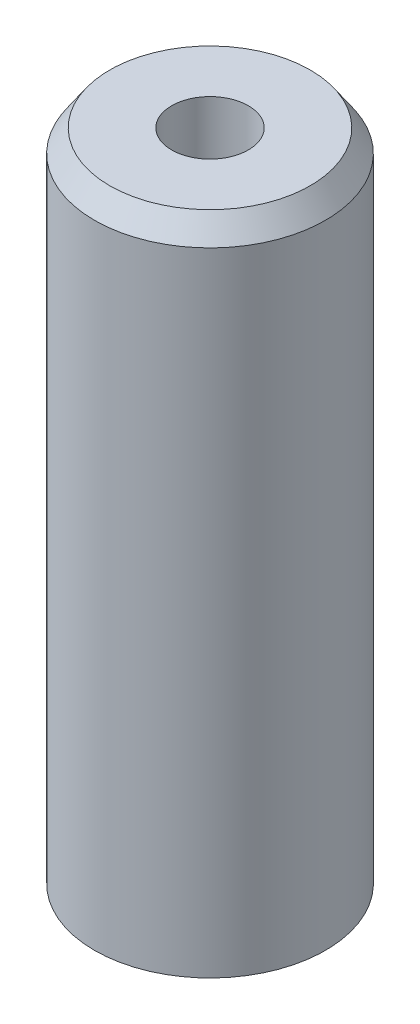
ISO-10303-21;
HEADER;
FILE_DESCRIPTION(('STEP AP214'),'2;1');
FILE_NAME('part.step','',(''),(''),'','','');
FILE_SCHEMA(('AUTOMOTIVE_DESIGN { 1 0 10303 214 1 1 1 1 }'));
ENDSEC;
DATA;
#1=APPLICATION_CONTEXT('core data for automotive mechanical design processes');
#2=APPLICATION_PROTOCOL_DEFINITION('international standard','automotive_design',2000,#1);
#3=PRODUCT_CONTEXT('',#1,'mechanical');
#4=PRODUCT('Part','Part','',(#3));
#5=PRODUCT_RELATED_PRODUCT_CATEGORY('part','',(#4));
#6=PRODUCT_DEFINITION_FORMATION('','',#4);
#7=PRODUCT_DEFINITION_CONTEXT('part definition',#1,'design');
#8=PRODUCT_DEFINITION('design','',#6,#7);
#9=PRODUCT_DEFINITION_SHAPE('','',#8);
#10=(LENGTH_UNIT() NAMED_UNIT(*) SI_UNIT(.MILLI.,.METRE.));
#11=(NAMED_UNIT(*) PLANE_ANGLE_UNIT() SI_UNIT($,.RADIAN.));
#12=(NAMED_UNIT(*) SI_UNIT($,.STERADIAN.) SOLID_ANGLE_UNIT());
#13=UNCERTAINTY_MEASURE_WITH_UNIT(LENGTH_MEASURE(1.E-05),#10,'distance_accuracy_value','');
#14=(GEOMETRIC_REPRESENTATION_CONTEXT(3) GLOBAL_UNCERTAINTY_ASSIGNED_CONTEXT((#13)) GLOBAL_UNIT_ASSIGNED_CONTEXT((#10,
#11,#12)) REPRESENTATION_CONTEXT('',''));
#15=CARTESIAN_POINT('',(0.,0.,0.));
#16=DIRECTION('',(0.,0.,1.));
#17=DIRECTION('',(1.,0.,0.));
#18=AXIS2_PLACEMENT_3D('',#15,#16,#17);
#19=CARTESIAN_POINT('',(0.,159.441665289434,0.));
#20=DIRECTION('',(0.,-1.,0.));
#21=DIRECTION('',(0.,0.,-1.));
#22=AXIS2_PLACEMENT_3D('',#19,#20,#21);
#23=CYLINDRICAL_SURFACE('',#22,27.5);
#24=CARTESIAN_POINT('',(0.,154.132473192236,0.));
#25=DIRECTION('',(0.,1.,0.));
#26=DIRECTION('',(0.,0.,1.));
#27=AXIS2_PLACEMENT_3D('',#24,#25,#26);
#28=CIRCLE('',#27,27.5);
#29=CARTESIAN_POINT('',(0.,154.132473192236,27.5));
#30=VERTEX_POINT('',#29);
#31=EDGE_CURVE('E50',#30,#30,#28,.F.);
#32=ORIENTED_EDGE('',*,*,#31,.T.);
#33=EDGE_LOOP('',(#32));
#34=FACE_BOUND('',#33,.T.);
#35=CARTESIAN_POINT('',(0.,3.63032318695186,0.));
#36=DIRECTION('',(0.,1.,0.));
#37=DIRECTION('',(0.,0.,1.));
#38=AXIS2_PLACEMENT_3D('',#35,#36,#37);
#39=CIRCLE('',#38,27.5);
#40=CARTESIAN_POINT('',(0.,3.63032318695186,27.5));
#41=VERTEX_POINT('',#40);
#42=EDGE_CURVE('E51',#41,#41,#39,.T.);
#43=ORIENTED_EDGE('',*,*,#42,.T.);
#44=EDGE_LOOP('',(#43));
#45=FACE_BOUND('',#44,.T.);
#46=ADVANCED_FACE('F39',(#34,#45),#23,.T.);
#47=CARTESIAN_POINT('',(0.,159.441665289434,0.));
#48=DIRECTION('',(0.,1.,0.));
#49=DIRECTION('',(0.,0.,1.));
#50=AXIS2_PLACEMENT_3D('',#47,#48,#49);
#51=PLANE('',#50);
#52=CARTESIAN_POINT('',(0.,159.441665289434,0.));
#53=DIRECTION('',(0.,1.,0.));
#54=DIRECTION('',(0.,0.,1.));
#55=AXIS2_PLACEMENT_3D('',#52,#53,#54);
#56=CIRCLE('',#55,23.8696768130482);
#57=CARTESIAN_POINT('',(0.,159.441665289434,23.8696768130482));
#58=VERTEX_POINT('',#57);
#59=EDGE_CURVE('E54',#58,#58,#56,.T.);
#60=ORIENTED_EDGE('',*,*,#59,.T.);
#61=EDGE_LOOP('',(#60));
#62=FACE_BOUND('',#61,.T.);
#63=CARTESIAN_POINT('',(0.,159.441665289434,0.));
#64=DIRECTION('',(0.,1.,0.));
#65=DIRECTION('',(0.,0.,1.));
#66=AXIS2_PLACEMENT_3D('',#63,#64,#65);
#67=CIRCLE('',#66,9.126958465946);
#68=CARTESIAN_POINT('',(0.,159.441665289434,9.126958465946));
#69=VERTEX_POINT('',#68);
#70=EDGE_CURVE('E58',#69,#69,#67,.T.);
#71=ORIENTED_EDGE('',*,*,#70,.F.);
#72=EDGE_LOOP('',(#71));
#73=FACE_BOUND('',#72,.T.);
#74=ADVANCED_FACE('F69',(#62,#73),#51,.T.);
#75=CARTESIAN_POINT('',(0.,0.,0.));
#76=DIRECTION('',(0.,1.,0.));
#77=DIRECTION('',(0.,0.,1.));
#78=AXIS2_PLACEMENT_3D('',#75,#76,#77);
#79=PLANE('',#78);
#80=CARTESIAN_POINT('',(0.,0.,0.));
#81=DIRECTION('',(0.,1.,0.));
#82=DIRECTION('',(0.,0.,1.));
#83=AXIS2_PLACEMENT_3D('',#80,#81,#82);
#84=CIRCLE('',#83,22.1908079028014);
#85=CARTESIAN_POINT('',(0.,0.,22.1908079028014));
#86=VERTEX_POINT('',#85);
#87=EDGE_CURVE('E10',#86,#86,#84,.F.);
#88=ORIENTED_EDGE('',*,*,#87,.T.);
#89=EDGE_LOOP('',(#88));
#90=FACE_BOUND('',#89,.T.);
#91=CARTESIAN_POINT('',(0.,0.,0.));
#92=DIRECTION('',(0.,1.,0.));
#93=DIRECTION('',(0.,0.,1.));
#94=AXIS2_PLACEMENT_3D('',#91,#92,#93);
#95=CIRCLE('',#94,9.126958465946);
#96=CARTESIAN_POINT('',(0.,0.,9.126958465946));
#97=VERTEX_POINT('',#96);
#98=EDGE_CURVE('E63',#97,#97,#95,.T.);
#99=ORIENTED_EDGE('',*,*,#98,.T.);
#100=EDGE_LOOP('',(#99));
#101=FACE_BOUND('',#100,.T.);
#102=ADVANCED_FACE('F75',(#90,#101),#79,.F.);
#103=CARTESIAN_POINT('',(0.,159.441665289434,0.));
#104=DIRECTION('',(0.,-1.,0.));
#105=DIRECTION('',(0.,0.,-1.));
#106=AXIS2_PLACEMENT_3D('',#103,#104,#105);
#107=CYLINDRICAL_SURFACE('',#106,9.126958465946);
#108=ORIENTED_EDGE('',*,*,#70,.T.);
#109=EDGE_LOOP('',(#108));
#110=FACE_BOUND('',#109,.T.);
#111=ORIENTED_EDGE('',*,*,#98,.F.);
#112=EDGE_LOOP('',(#111));
#113=FACE_BOUND('',#112,.T.);
#114=ADVANCED_FACE('F70',(#110,#113),#107,.F.);
#115=CARTESIAN_POINT('',(0.,159.441665289434,0.));
#116=DIRECTION('',(0.,-1.,0.));
#117=DIRECTION('',(0.,0.,-1.));
#118=AXIS2_PLACEMENT_3D('',#115,#116,#117);
#119=CONICAL_SURFACE('',#118,23.8696768130482,0.599757398877407);
#120=ORIENTED_EDGE('',*,*,#31,.F.);
#121=EDGE_LOOP('',(#120));
#122=FACE_BOUND('',#121,.T.);
#123=ORIENTED_EDGE('',*,*,#59,.F.);
#124=EDGE_LOOP('',(#123));
#125=FACE_BOUND('',#124,.T.);
#126=ADVANCED_FACE('F81',(#122,#125),#119,.T.);
#127=CARTESIAN_POINT('',(0.,3.63032318695186,0.));
#128=DIRECTION('',(0.,1.,0.));
#129=DIRECTION('',(0.,0.,1.));
#130=AXIS2_PLACEMENT_3D('',#127,#128,#129);
#131=CONICAL_SURFACE('',#130,27.5,0.971038927917491);
#132=ORIENTED_EDGE('',*,*,#87,.F.);
#133=EDGE_LOOP('',(#132));
#134=FACE_BOUND('',#133,.T.);
#135=ORIENTED_EDGE('',*,*,#42,.F.);
#136=EDGE_LOOP('',(#135));
#137=FACE_BOUND('',#136,.T.);
#138=ADVANCED_FACE('F45',(#134,#137),#131,.T.);
#139=CLOSED_SHELL('',(#46,#74,#102,#114,#126,#138));
#140=MANIFOLD_SOLID_BREP('B2',#139);
#141=ADVANCED_BREP_SHAPE_REPRESENTATION('',(#18,#140),#14);
#142=SHAPE_DEFINITION_REPRESENTATION(#9,#141);
ENDSEC;
END-ISO-10303-21;
